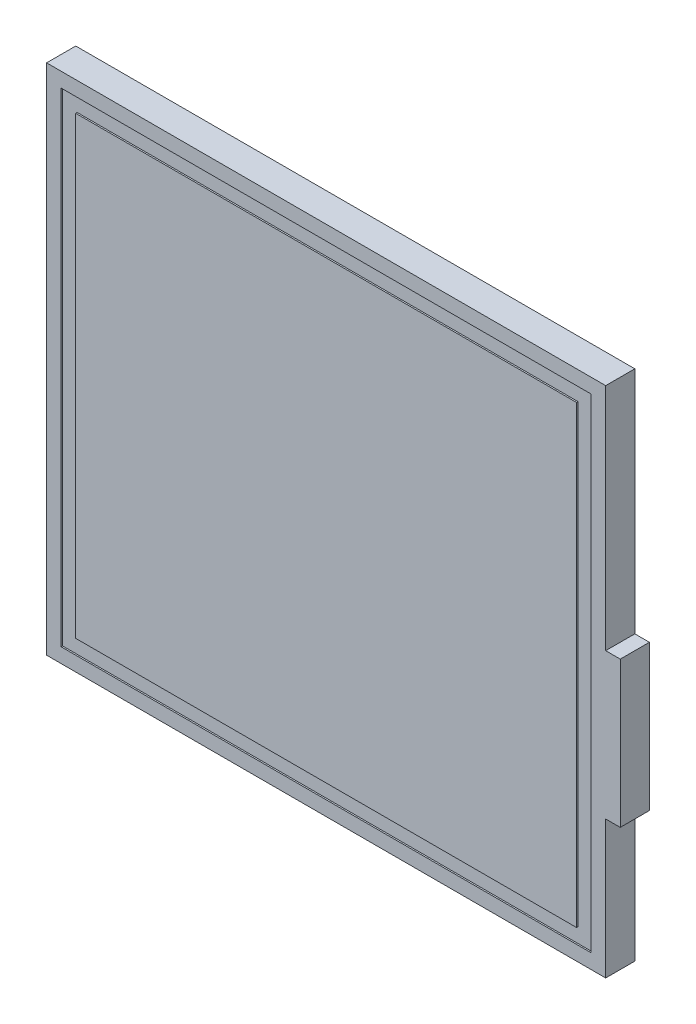
ISO-10303-21;
HEADER;
FILE_DESCRIPTION(('STEP AP214'),'2;1');
FILE_NAME('part.step','',(''),(''),'','','');
FILE_SCHEMA(('AUTOMOTIVE_DESIGN { 1 0 10303 214 1 1 1 1 }'));
ENDSEC;
DATA;
#1=APPLICATION_CONTEXT('core data for automotive mechanical design processes');
#2=APPLICATION_PROTOCOL_DEFINITION('international standard','automotive_design',2000,#1);
#3=PRODUCT_CONTEXT('',#1,'mechanical');
#4=PRODUCT('Part','Part','',(#3));
#5=PRODUCT_RELATED_PRODUCT_CATEGORY('part','',(#4));
#6=PRODUCT_DEFINITION_FORMATION('','',#4);
#7=PRODUCT_DEFINITION_CONTEXT('part definition',#1,'design');
#8=PRODUCT_DEFINITION('design','',#6,#7);
#9=PRODUCT_DEFINITION_SHAPE('','',#8);
#10=(LENGTH_UNIT() NAMED_UNIT(*) SI_UNIT(.MILLI.,.METRE.));
#11=(NAMED_UNIT(*) PLANE_ANGLE_UNIT() SI_UNIT($,.RADIAN.));
#12=(NAMED_UNIT(*) SI_UNIT($,.STERADIAN.) SOLID_ANGLE_UNIT());
#13=UNCERTAINTY_MEASURE_WITH_UNIT(LENGTH_MEASURE(1.E-05),#10,'distance_accuracy_value','');
#14=(GEOMETRIC_REPRESENTATION_CONTEXT(3) GLOBAL_UNCERTAINTY_ASSIGNED_CONTEXT((#13)) GLOBAL_UNIT_ASSIGNED_CONTEXT((#10,
#11,#12)) REPRESENTATION_CONTEXT('',''));
#15=CARTESIAN_POINT('',(0.,0.,0.));
#16=DIRECTION('',(0.,0.,1.));
#17=DIRECTION('',(1.,0.,0.));
#18=AXIS2_PLACEMENT_3D('',#15,#16,#17);
#19=CARTESIAN_POINT('',(19.18,-33.95,5.));
#20=DIRECTION('',(-1.,0.,0.));
#21=DIRECTION('',(0.,0.,1.));
#22=AXIS2_PLACEMENT_3D('',#19,#20,#21);
#23=PLANE('',#22);
#24=DIRECTION('',(0.,0.,-1.));
#25=VECTOR('',#24,1.);
#26=CARTESIAN_POINT('',(19.18,-33.95,5.));
#27=LINE('',#26,#25);
#28=CARTESIAN_POINT('',(19.18,-33.95,5.));
#29=VERTEX_POINT('',#28);
#30=CARTESIAN_POINT('',(19.18,-33.95,3.));
#31=VERTEX_POINT('',#30);
#32=EDGE_CURVE('E362',#29,#31,#27,.T.);
#33=ORIENTED_EDGE('',*,*,#32,.T.);
#34=DIRECTION('',(0.,-1.,0.));
#35=VECTOR('',#34,1.);
#36=CARTESIAN_POINT('',(19.18,-24.5,3.));
#37=LINE('',#36,#35);
#38=CARTESIAN_POINT('',(19.18,-24.5,3.));
#39=VERTEX_POINT('',#38);
#40=EDGE_CURVE('E331',#39,#31,#37,.T.);
#41=ORIENTED_EDGE('',*,*,#40,.F.);
#42=DIRECTION('',(0.,0.,-1.));
#43=VECTOR('',#42,1.);
#44=CARTESIAN_POINT('',(19.18,-24.5,5.));
#45=LINE('',#44,#43);
#46=CARTESIAN_POINT('',(19.18,-24.5,5.));
#47=VERTEX_POINT('',#46);
#48=EDGE_CURVE('E11',#47,#39,#45,.T.);
#49=ORIENTED_EDGE('',*,*,#48,.F.);
#50=DIRECTION('',(0.,1.,0.));
#51=VECTOR('',#50,1.);
#52=CARTESIAN_POINT('',(19.18,-33.95,5.));
#53=LINE('',#52,#51);
#54=EDGE_CURVE('E345',#29,#47,#53,.T.);
#55=ORIENTED_EDGE('',*,*,#54,.F.);
#56=EDGE_LOOP('',(#33,#41,#49,#55));
#57=FACE_BOUND('',#56,.T.);
#58=ADVANCED_FACE('F36',(#57),#23,.F.);
#59=CARTESIAN_POINT('',(19.18,-24.5,5.));
#60=DIRECTION('',(0.,1.,0.));
#61=DIRECTION('',(0.,0.,1.));
#62=AXIS2_PLACEMENT_3D('',#59,#60,#61);
#63=PLANE('',#62);
#64=ORIENTED_EDGE('',*,*,#48,.T.);
#65=DIRECTION('',(-1.,0.,0.));
#66=VECTOR('',#65,1.);
#67=CARTESIAN_POINT('',(20.18,-24.5,3.));
#68=LINE('',#67,#66);
#69=CARTESIAN_POINT('',(20.18,-24.5,3.));
#70=VERTEX_POINT('',#69);
#71=EDGE_CURVE('E315',#70,#39,#68,.T.);
#72=ORIENTED_EDGE('',*,*,#71,.F.);
#73=DIRECTION('',(0.,0.,-1.));
#74=VECTOR('',#73,1.);
#75=CARTESIAN_POINT('',(20.18,-24.5,5.));
#76=LINE('',#75,#74);
#77=CARTESIAN_POINT('',(20.18,-24.5,5.));
#78=VERTEX_POINT('',#77);
#79=EDGE_CURVE('E43',#78,#70,#76,.T.);
#80=ORIENTED_EDGE('',*,*,#79,.F.);
#81=DIRECTION('',(1.,0.,0.));
#82=VECTOR('',#81,1.);
#83=CARTESIAN_POINT('',(19.18,-24.5,5.));
#84=LINE('',#83,#82);
#85=EDGE_CURVE('E348',#47,#78,#84,.T.);
#86=ORIENTED_EDGE('',*,*,#85,.F.);
#87=EDGE_LOOP('',(#64,#72,#80,#86));
#88=FACE_BOUND('',#87,.T.);
#89=ADVANCED_FACE('F388',(#88),#63,.F.);
#90=CARTESIAN_POINT('',(20.18,-24.5,5.));
#91=DIRECTION('',(-1.,0.,0.));
#92=DIRECTION('',(0.,0.,1.));
#93=AXIS2_PLACEMENT_3D('',#90,#91,#92);
#94=PLANE('',#93);
#95=ORIENTED_EDGE('',*,*,#79,.T.);
#96=DIRECTION('',(0.,-1.,0.));
#97=VECTOR('',#96,1.);
#98=CARTESIAN_POINT('',(20.18,-14.5,3.));
#99=LINE('',#98,#97);
#100=CARTESIAN_POINT('',(20.18,-14.5,3.));
#101=VERTEX_POINT('',#100);
#102=EDGE_CURVE('E343',#101,#70,#99,.T.);
#103=ORIENTED_EDGE('',*,*,#102,.F.);
#104=DIRECTION('',(0.,0.,-1.));
#105=VECTOR('',#104,1.);
#106=CARTESIAN_POINT('',(20.18,-14.5,5.));
#107=LINE('',#106,#105);
#108=CARTESIAN_POINT('',(20.18,-14.5,5.));
#109=VERTEX_POINT('',#108);
#110=EDGE_CURVE('E377',#109,#101,#107,.T.);
#111=ORIENTED_EDGE('',*,*,#110,.F.);
#112=DIRECTION('',(0.,1.,0.));
#113=VECTOR('',#112,1.);
#114=CARTESIAN_POINT('',(20.18,-24.5,5.));
#115=LINE('',#114,#113);
#116=EDGE_CURVE('E350',#78,#109,#115,.T.);
#117=ORIENTED_EDGE('',*,*,#116,.F.);
#118=EDGE_LOOP('',(#95,#103,#111,#117));
#119=FACE_BOUND('',#118,.T.);
#120=ADVANCED_FACE('F384',(#119),#94,.F.);
#121=CARTESIAN_POINT('',(20.18,-14.5,5.));
#122=DIRECTION('',(0.,-1.,0.));
#123=DIRECTION('',(0.,0.,-1.));
#124=AXIS2_PLACEMENT_3D('',#121,#122,#123);
#125=PLANE('',#124);
#126=ORIENTED_EDGE('',*,*,#110,.T.);
#127=DIRECTION('',(1.,0.,0.));
#128=VECTOR('',#127,1.);
#129=CARTESIAN_POINT('',(19.18,-14.5,3.));
#130=LINE('',#129,#128);
#131=CARTESIAN_POINT('',(19.18,-14.5,3.));
#132=VERTEX_POINT('',#131);
#133=EDGE_CURVE('E341',#132,#101,#130,.T.);
#134=ORIENTED_EDGE('',*,*,#133,.F.);
#135=DIRECTION('',(0.,0.,-1.));
#136=VECTOR('',#135,1.);
#137=CARTESIAN_POINT('',(19.18,-14.5,5.));
#138=LINE('',#137,#136);
#139=CARTESIAN_POINT('',(19.18,-14.5,5.));
#140=VERTEX_POINT('',#139);
#141=EDGE_CURVE('E374',#140,#132,#138,.T.);
#142=ORIENTED_EDGE('',*,*,#141,.F.);
#143=DIRECTION('',(-1.,0.,0.));
#144=VECTOR('',#143,1.);
#145=CARTESIAN_POINT('',(20.18,-14.5,5.));
#146=LINE('',#145,#144);
#147=EDGE_CURVE('E352',#109,#140,#146,.T.);
#148=ORIENTED_EDGE('',*,*,#147,.F.);
#149=EDGE_LOOP('',(#126,#134,#142,#148));
#150=FACE_BOUND('',#149,.T.);
#151=ADVANCED_FACE('F419',(#150),#125,.F.);
#152=CARTESIAN_POINT('',(19.18,-14.5,5.));
#153=DIRECTION('',(-1.,0.,0.));
#154=DIRECTION('',(0.,0.,1.));
#155=AXIS2_PLACEMENT_3D('',#152,#153,#154);
#156=PLANE('',#155);
#157=ORIENTED_EDGE('',*,*,#141,.T.);
#158=DIRECTION('',(0.,-1.,0.));
#159=VECTOR('',#158,1.);
#160=CARTESIAN_POINT('',(19.18,1.25,3.));
#161=LINE('',#160,#159);
#162=CARTESIAN_POINT('',(19.18,1.25,3.));
#163=VERTEX_POINT('',#162);
#164=EDGE_CURVE('E339',#163,#132,#161,.T.);
#165=ORIENTED_EDGE('',*,*,#164,.F.);
#166=DIRECTION('',(0.,0.,-1.));
#167=VECTOR('',#166,1.);
#168=CARTESIAN_POINT('',(19.18,1.25,5.));
#169=LINE('',#168,#167);
#170=CARTESIAN_POINT('',(19.18,1.25,5.));
#171=VERTEX_POINT('',#170);
#172=EDGE_CURVE('E371',#171,#163,#169,.T.);
#173=ORIENTED_EDGE('',*,*,#172,.F.);
#174=DIRECTION('',(0.,1.,0.));
#175=VECTOR('',#174,1.);
#176=CARTESIAN_POINT('',(19.18,-14.5,5.));
#177=LINE('',#176,#175);
#178=EDGE_CURVE('E354',#140,#171,#177,.T.);
#179=ORIENTED_EDGE('',*,*,#178,.F.);
#180=EDGE_LOOP('',(#157,#165,#173,#179));
#181=FACE_BOUND('',#180,.T.);
#182=ADVANCED_FACE('F414',(#181),#156,.F.);
#183=CARTESIAN_POINT('',(19.18,1.25,5.));
#184=DIRECTION('',(0.,-1.,0.));
#185=DIRECTION('',(0.,0.,-1.));
#186=AXIS2_PLACEMENT_3D('',#183,#184,#185);
#187=PLANE('',#186);
#188=ORIENTED_EDGE('',*,*,#172,.T.);
#189=DIRECTION('',(1.,0.,0.));
#190=VECTOR('',#189,1.);
#191=CARTESIAN_POINT('',(-19.18,1.25,3.));
#192=LINE('',#191,#190);
#193=CARTESIAN_POINT('',(-19.18,1.25,3.));
#194=VERTEX_POINT('',#193);
#195=EDGE_CURVE('E337',#194,#163,#192,.T.);
#196=ORIENTED_EDGE('',*,*,#195,.F.);
#197=DIRECTION('',(0.,0.,-1.));
#198=VECTOR('',#197,1.);
#199=CARTESIAN_POINT('',(-19.18,1.25,5.));
#200=LINE('',#199,#198);
#201=CARTESIAN_POINT('',(-19.18,1.25,5.));
#202=VERTEX_POINT('',#201);
#203=EDGE_CURVE('E368',#202,#194,#200,.T.);
#204=ORIENTED_EDGE('',*,*,#203,.F.);
#205=DIRECTION('',(-1.,0.,0.));
#206=VECTOR('',#205,1.);
#207=CARTESIAN_POINT('',(19.18,1.25,5.));
#208=LINE('',#207,#206);
#209=EDGE_CURVE('E356',#171,#202,#208,.T.);
#210=ORIENTED_EDGE('',*,*,#209,.F.);
#211=EDGE_LOOP('',(#188,#196,#204,#210));
#212=FACE_BOUND('',#211,.T.);
#213=ADVANCED_FACE('F409',(#212),#187,.F.);
#214=CARTESIAN_POINT('',(-19.18,1.25,5.));
#215=DIRECTION('',(1.,0.,0.));
#216=DIRECTION('',(0.,0.,-1.));
#217=AXIS2_PLACEMENT_3D('',#214,#215,#216);
#218=PLANE('',#217);
#219=ORIENTED_EDGE('',*,*,#203,.T.);
#220=DIRECTION('',(0.,1.,0.));
#221=VECTOR('',#220,1.);
#222=CARTESIAN_POINT('',(-19.18,-33.95,3.));
#223=LINE('',#222,#221);
#224=CARTESIAN_POINT('',(-19.18,-33.95,3.));
#225=VERTEX_POINT('',#224);
#226=EDGE_CURVE('E335',#225,#194,#223,.T.);
#227=ORIENTED_EDGE('',*,*,#226,.F.);
#228=DIRECTION('',(0.,0.,-1.));
#229=VECTOR('',#228,1.);
#230=CARTESIAN_POINT('',(-19.18,-33.95,5.));
#231=LINE('',#230,#229);
#232=CARTESIAN_POINT('',(-19.18,-33.95,5.));
#233=VERTEX_POINT('',#232);
#234=EDGE_CURVE('E365',#233,#225,#231,.T.);
#235=ORIENTED_EDGE('',*,*,#234,.F.);
#236=DIRECTION('',(0.,-1.,0.));
#237=VECTOR('',#236,1.);
#238=CARTESIAN_POINT('',(-19.18,1.25,5.));
#239=LINE('',#238,#237);
#240=EDGE_CURVE('E358',#202,#233,#239,.T.);
#241=ORIENTED_EDGE('',*,*,#240,.F.);
#242=EDGE_LOOP('',(#219,#227,#235,#241));
#243=FACE_BOUND('',#242,.T.);
#244=ADVANCED_FACE('F404',(#243),#218,.F.);
#245=CARTESIAN_POINT('',(-19.18,-33.95,5.));
#246=DIRECTION('',(0.,1.,0.));
#247=DIRECTION('',(0.,0.,1.));
#248=AXIS2_PLACEMENT_3D('',#245,#246,#247);
#249=PLANE('',#248);
#250=ORIENTED_EDGE('',*,*,#234,.T.);
#251=DIRECTION('',(-1.,0.,0.));
#252=VECTOR('',#251,1.);
#253=CARTESIAN_POINT('',(19.18,-33.95,3.));
#254=LINE('',#253,#252);
#255=EDGE_CURVE('E333',#31,#225,#254,.T.);
#256=ORIENTED_EDGE('',*,*,#255,.F.);
#257=ORIENTED_EDGE('',*,*,#32,.F.);
#258=DIRECTION('',(1.,0.,0.));
#259=VECTOR('',#258,1.);
#260=CARTESIAN_POINT('',(-19.18,-33.95,5.));
#261=LINE('',#260,#259);
#262=EDGE_CURVE('E360',#233,#29,#261,.T.);
#263=ORIENTED_EDGE('',*,*,#262,.F.);
#264=EDGE_LOOP('',(#250,#256,#257,#263));
#265=FACE_BOUND('',#264,.T.);
#266=ADVANCED_FACE('F399',(#265),#249,.F.);
#267=CARTESIAN_POINT('',(19.18,-24.5,5.));
#268=DIRECTION('',(0.,0.,-1.));
#269=DIRECTION('',(-1.,0.,0.));
#270=AXIS2_PLACEMENT_3D('',#267,#268,#269);
#271=PLANE('',#270);
#272=DIRECTION('',(0.,1.,0.));
#273=VECTOR('',#272,1.);
#274=CARTESIAN_POINT('',(18.18,-32.95,5.));
#275=LINE('',#274,#273);
#276=CARTESIAN_POINT('',(18.18,-32.95,5.));
#277=VERTEX_POINT('',#276);
#278=CARTESIAN_POINT('',(18.18,0.25,5.));
#279=VERTEX_POINT('',#278);
#280=EDGE_CURVE('E235',#277,#279,#275,.T.);
#281=ORIENTED_EDGE('',*,*,#280,.F.);
#282=DIRECTION('',(1.,0.,0.));
#283=VECTOR('',#282,1.);
#284=CARTESIAN_POINT('',(-18.18,-32.95,5.));
#285=LINE('',#284,#283);
#286=CARTESIAN_POINT('',(-18.18,-32.95,5.));
#287=VERTEX_POINT('',#286);
#288=EDGE_CURVE('E50',#287,#277,#285,.T.);
#289=ORIENTED_EDGE('',*,*,#288,.F.);
#290=DIRECTION('',(0.,-1.,0.));
#291=VECTOR('',#290,1.);
#292=CARTESIAN_POINT('',(-18.18,0.25,5.));
#293=LINE('',#292,#291);
#294=CARTESIAN_POINT('',(-18.18,0.25,5.));
#295=VERTEX_POINT('',#294);
#296=EDGE_CURVE('E241',#295,#287,#293,.T.);
#297=ORIENTED_EDGE('',*,*,#296,.F.);
#298=DIRECTION('',(-1.,0.,0.));
#299=VECTOR('',#298,1.);
#300=CARTESIAN_POINT('',(18.18,0.25,5.));
#301=LINE('',#300,#299);
#302=EDGE_CURVE('E238',#279,#295,#301,.T.);
#303=ORIENTED_EDGE('',*,*,#302,.F.);
#304=EDGE_LOOP('',(#281,#289,#297,#303));
#305=FACE_BOUND('',#304,.T.);
#306=ORIENTED_EDGE('',*,*,#54,.T.);
#307=ORIENTED_EDGE('',*,*,#85,.T.);
#308=ORIENTED_EDGE('',*,*,#116,.T.);
#309=ORIENTED_EDGE('',*,*,#147,.T.);
#310=ORIENTED_EDGE('',*,*,#178,.T.);
#311=ORIENTED_EDGE('',*,*,#209,.T.);
#312=ORIENTED_EDGE('',*,*,#240,.T.);
#313=ORIENTED_EDGE('',*,*,#262,.T.);
#314=EDGE_LOOP('',(#306,#307,#308,#309,#310,#311,#312,#313));
#315=FACE_BOUND('',#314,.T.);
#316=ADVANCED_FACE('F421',(#305,#315),#271,.F.);
#317=CARTESIAN_POINT('',(19.18,-24.5,3.));
#318=DIRECTION('',(0.,0.,1.));
#319=DIRECTION('',(1.,0.,0.));
#320=AXIS2_PLACEMENT_3D('',#317,#318,#319);
#321=PLANE('',#320);
#322=DIRECTION('',(-1.,0.,0.));
#323=VECTOR('',#322,1.);
#324=CARTESIAN_POINT('',(17.18,-21.5,3.));
#325=LINE('',#324,#323);
#326=CARTESIAN_POINT('',(17.18,-21.5,3.));
#327=VERTEX_POINT('',#326);
#328=CARTESIAN_POINT('',(16.18,-21.5,3.));
#329=VERTEX_POINT('',#328);
#330=EDGE_CURVE('E288',#327,#329,#325,.T.);
#331=ORIENTED_EDGE('',*,*,#330,.F.);
#332=DIRECTION('',(0.,-1.,0.));
#333=VECTOR('',#332,1.);
#334=CARTESIAN_POINT('',(17.18,-17.5,3.));
#335=LINE('',#334,#333);
#336=CARTESIAN_POINT('',(17.18,-17.5,3.));
#337=VERTEX_POINT('',#336);
#338=EDGE_CURVE('E309',#337,#327,#335,.T.);
#339=ORIENTED_EDGE('',*,*,#338,.F.);
#340=DIRECTION('',(1.,0.,0.));
#341=VECTOR('',#340,1.);
#342=CARTESIAN_POINT('',(16.18,-17.5,3.));
#343=LINE('',#342,#341);
#344=CARTESIAN_POINT('',(16.18,-17.5,3.));
#345=VERTEX_POINT('',#344);
#346=EDGE_CURVE('E306',#345,#337,#343,.T.);
#347=ORIENTED_EDGE('',*,*,#346,.F.);
#348=DIRECTION('',(0.,-1.,0.));
#349=VECTOR('',#348,1.);
#350=CARTESIAN_POINT('',(16.18,-1.75,3.));
#351=LINE('',#350,#349);
#352=CARTESIAN_POINT('',(16.18,-1.75,3.));
#353=VERTEX_POINT('',#352);
#354=EDGE_CURVE('E303',#353,#345,#351,.T.);
#355=ORIENTED_EDGE('',*,*,#354,.F.);
#356=DIRECTION('',(1.,0.,0.));
#357=VECTOR('',#356,1.);
#358=CARTESIAN_POINT('',(-16.18,-1.75,3.));
#359=LINE('',#358,#357);
#360=CARTESIAN_POINT('',(-16.18,-1.75,3.));
#361=VERTEX_POINT('',#360);
#362=EDGE_CURVE('E300',#361,#353,#359,.T.);
#363=ORIENTED_EDGE('',*,*,#362,.F.);
#364=DIRECTION('',(0.,1.,0.));
#365=VECTOR('',#364,1.);
#366=CARTESIAN_POINT('',(-16.18,-30.95,3.));
#367=LINE('',#366,#365);
#368=CARTESIAN_POINT('',(-16.18,-30.95,3.));
#369=VERTEX_POINT('',#368);
#370=EDGE_CURVE('E297',#369,#361,#367,.T.);
#371=ORIENTED_EDGE('',*,*,#370,.F.);
#372=DIRECTION('',(-1.,0.,0.));
#373=VECTOR('',#372,1.);
#374=CARTESIAN_POINT('',(16.18,-30.95,3.));
#375=LINE('',#374,#373);
#376=CARTESIAN_POINT('',(16.18,-30.95,3.));
#377=VERTEX_POINT('',#376);
#378=EDGE_CURVE('E294',#377,#369,#375,.T.);
#379=ORIENTED_EDGE('',*,*,#378,.F.);
#380=DIRECTION('',(0.,-1.,0.));
#381=VECTOR('',#380,1.);
#382=CARTESIAN_POINT('',(16.18,-21.5,3.));
#383=LINE('',#382,#381);
#384=EDGE_CURVE('E291',#329,#377,#383,.T.);
#385=ORIENTED_EDGE('',*,*,#384,.F.);
#386=EDGE_LOOP('',(#331,#339,#347,#355,#363,#371,#379,#385));
#387=FACE_BOUND('',#386,.T.);
#388=ORIENTED_EDGE('',*,*,#71,.T.);
#389=ORIENTED_EDGE('',*,*,#40,.T.);
#390=ORIENTED_EDGE('',*,*,#255,.T.);
#391=ORIENTED_EDGE('',*,*,#226,.T.);
#392=ORIENTED_EDGE('',*,*,#195,.T.);
#393=ORIENTED_EDGE('',*,*,#164,.T.);
#394=ORIENTED_EDGE('',*,*,#133,.T.);
#395=ORIENTED_EDGE('',*,*,#102,.T.);
#396=EDGE_LOOP('',(#388,#389,#390,#391,#392,#393,#394,#395));
#397=FACE_BOUND('',#396,.T.);
#398=ADVANCED_FACE('F392',(#387,#397),#321,.F.);
#399=CARTESIAN_POINT('',(17.18,-21.5,3.));
#400=DIRECTION('',(0.,-1.,0.));
#401=DIRECTION('',(0.,0.,-1.));
#402=AXIS2_PLACEMENT_3D('',#399,#400,#401);
#403=PLANE('',#402);
#404=DIRECTION('',(-1.,0.,0.));
#405=VECTOR('',#404,1.);
#406=CARTESIAN_POINT('',(17.18,-21.5,0.));
#407=LINE('',#406,#405);
#408=CARTESIAN_POINT('',(17.18,-21.5,0.));
#409=VERTEX_POINT('',#408);
#410=CARTESIAN_POINT('',(16.18,-21.5,0.));
#411=VERTEX_POINT('',#410);
#412=EDGE_CURVE('E259',#409,#411,#407,.T.);
#413=ORIENTED_EDGE('',*,*,#412,.F.);
#414=DIRECTION('',(0.,0.,-1.));
#415=VECTOR('',#414,1.);
#416=CARTESIAN_POINT('',(17.18,-21.5,3.));
#417=LINE('',#416,#415);
#418=EDGE_CURVE('E313',#327,#409,#417,.T.);
#419=ORIENTED_EDGE('',*,*,#418,.F.);
#420=ORIENTED_EDGE('',*,*,#330,.T.);
#421=DIRECTION('',(0.,0.,-1.));
#422=VECTOR('',#421,1.);
#423=CARTESIAN_POINT('',(16.18,-21.5,3.));
#424=LINE('',#423,#422);
#425=EDGE_CURVE('E312',#329,#411,#424,.T.);
#426=ORIENTED_EDGE('',*,*,#425,.T.);
#427=EDGE_LOOP('',(#413,#419,#420,#426));
#428=FACE_BOUND('',#427,.T.);
#429=ADVANCED_FACE('F429',(#428),#403,.T.);
#430=CARTESIAN_POINT('',(17.18,-17.5,3.));
#431=DIRECTION('',(1.,0.,0.));
#432=DIRECTION('',(0.,0.,-1.));
#433=AXIS2_PLACEMENT_3D('',#430,#431,#432);
#434=PLANE('',#433);
#435=DIRECTION('',(0.,-1.,0.));
#436=VECTOR('',#435,1.);
#437=CARTESIAN_POINT('',(17.18,-17.5,0.));
#438=LINE('',#437,#436);
#439=CARTESIAN_POINT('',(17.18,-17.5,0.));
#440=VERTEX_POINT('',#439);
#441=EDGE_CURVE('E285',#440,#409,#438,.T.);
#442=ORIENTED_EDGE('',*,*,#441,.F.);
#443=DIRECTION('',(0.,0.,-1.));
#444=VECTOR('',#443,1.);
#445=CARTESIAN_POINT('',(17.18,-17.5,3.));
#446=LINE('',#445,#444);
#447=EDGE_CURVE('E316',#337,#440,#446,.T.);
#448=ORIENTED_EDGE('',*,*,#447,.F.);
#449=ORIENTED_EDGE('',*,*,#338,.T.);
#450=ORIENTED_EDGE('',*,*,#418,.T.);
#451=EDGE_LOOP('',(#442,#448,#449,#450));
#452=FACE_BOUND('',#451,.T.);
#453=ADVANCED_FACE('F478',(#452),#434,.T.);
#454=CARTESIAN_POINT('',(16.18,-17.5,3.));
#455=DIRECTION('',(0.,1.,0.));
#456=DIRECTION('',(0.,0.,1.));
#457=AXIS2_PLACEMENT_3D('',#454,#455,#456);
#458=PLANE('',#457);
#459=DIRECTION('',(1.,0.,0.));
#460=VECTOR('',#459,1.);
#461=CARTESIAN_POINT('',(16.18,-17.5,0.));
#462=LINE('',#461,#460);
#463=CARTESIAN_POINT('',(16.18,-17.5,0.));
#464=VERTEX_POINT('',#463);
#465=EDGE_CURVE('E282',#464,#440,#462,.T.);
#466=ORIENTED_EDGE('',*,*,#465,.F.);
#467=DIRECTION('',(0.,0.,-1.));
#468=VECTOR('',#467,1.);
#469=CARTESIAN_POINT('',(16.18,-17.5,3.));
#470=LINE('',#469,#468);
#471=EDGE_CURVE('E318',#345,#464,#470,.T.);
#472=ORIENTED_EDGE('',*,*,#471,.F.);
#473=ORIENTED_EDGE('',*,*,#346,.T.);
#474=ORIENTED_EDGE('',*,*,#447,.T.);
#475=EDGE_LOOP('',(#466,#472,#473,#474));
#476=FACE_BOUND('',#475,.T.);
#477=ADVANCED_FACE('F488',(#476),#458,.T.);
#478=CARTESIAN_POINT('',(16.18,-1.75,3.));
#479=DIRECTION('',(1.,0.,0.));
#480=DIRECTION('',(0.,0.,-1.));
#481=AXIS2_PLACEMENT_3D('',#478,#479,#480);
#482=PLANE('',#481);
#483=DIRECTION('',(0.,-1.,0.));
#484=VECTOR('',#483,1.);
#485=CARTESIAN_POINT('',(16.18,-1.75,0.));
#486=LINE('',#485,#484);
#487=CARTESIAN_POINT('',(16.18,-1.75,0.));
#488=VERTEX_POINT('',#487);
#489=EDGE_CURVE('E279',#488,#464,#486,.T.);
#490=ORIENTED_EDGE('',*,*,#489,.F.);
#491=DIRECTION('',(0.,0.,-1.));
#492=VECTOR('',#491,1.);
#493=CARTESIAN_POINT('',(16.18,-1.75,3.));
#494=LINE('',#493,#492);
#495=EDGE_CURVE('E320',#353,#488,#494,.T.);
#496=ORIENTED_EDGE('',*,*,#495,.F.);
#497=ORIENTED_EDGE('',*,*,#354,.T.);
#498=ORIENTED_EDGE('',*,*,#471,.T.);
#499=EDGE_LOOP('',(#490,#496,#497,#498));
#500=FACE_BOUND('',#499,.T.);
#501=ADVANCED_FACE('F498',(#500),#482,.T.);
#502=CARTESIAN_POINT('',(-16.18,-1.75,3.));
#503=DIRECTION('',(0.,1.,0.));
#504=DIRECTION('',(0.,0.,1.));
#505=AXIS2_PLACEMENT_3D('',#502,#503,#504);
#506=PLANE('',#505);
#507=DIRECTION('',(1.,0.,0.));
#508=VECTOR('',#507,1.);
#509=CARTESIAN_POINT('',(-16.18,-1.75,0.));
#510=LINE('',#509,#508);
#511=CARTESIAN_POINT('',(-16.18,-1.75,0.));
#512=VERTEX_POINT('',#511);
#513=EDGE_CURVE('E276',#512,#488,#510,.T.);
#514=ORIENTED_EDGE('',*,*,#513,.F.);
#515=DIRECTION('',(0.,0.,-1.));
#516=VECTOR('',#515,1.);
#517=CARTESIAN_POINT('',(-16.18,-1.75,3.));
#518=LINE('',#517,#516);
#519=EDGE_CURVE('E322',#361,#512,#518,.T.);
#520=ORIENTED_EDGE('',*,*,#519,.F.);
#521=ORIENTED_EDGE('',*,*,#362,.T.);
#522=ORIENTED_EDGE('',*,*,#495,.T.);
#523=EDGE_LOOP('',(#514,#520,#521,#522));
#524=FACE_BOUND('',#523,.T.);
#525=ADVANCED_FACE('F508',(#524),#506,.T.);
#526=CARTESIAN_POINT('',(-16.18,-30.95,3.));
#527=DIRECTION('',(-1.,0.,0.));
#528=DIRECTION('',(0.,0.,1.));
#529=AXIS2_PLACEMENT_3D('',#526,#527,#528);
#530=PLANE('',#529);
#531=DIRECTION('',(0.,1.,0.));
#532=VECTOR('',#531,1.);
#533=CARTESIAN_POINT('',(-16.18,-30.95,0.));
#534=LINE('',#533,#532);
#535=CARTESIAN_POINT('',(-16.18,-30.95,0.));
#536=VERTEX_POINT('',#535);
#537=EDGE_CURVE('E273',#536,#512,#534,.T.);
#538=ORIENTED_EDGE('',*,*,#537,.F.);
#539=DIRECTION('',(0.,0.,-1.));
#540=VECTOR('',#539,1.);
#541=CARTESIAN_POINT('',(-16.18,-30.95,3.));
#542=LINE('',#541,#540);
#543=EDGE_CURVE('E324',#369,#536,#542,.T.);
#544=ORIENTED_EDGE('',*,*,#543,.F.);
#545=ORIENTED_EDGE('',*,*,#370,.T.);
#546=ORIENTED_EDGE('',*,*,#519,.T.);
#547=EDGE_LOOP('',(#538,#544,#545,#546));
#548=FACE_BOUND('',#547,.T.);
#549=ADVANCED_FACE('F518',(#548),#530,.T.);
#550=CARTESIAN_POINT('',(16.18,-30.95,3.));
#551=DIRECTION('',(0.,-1.,0.));
#552=DIRECTION('',(0.,0.,-1.));
#553=AXIS2_PLACEMENT_3D('',#550,#551,#552);
#554=PLANE('',#553);
#555=DIRECTION('',(-1.,0.,0.));
#556=VECTOR('',#555,1.);
#557=CARTESIAN_POINT('',(16.18,-30.95,0.));
#558=LINE('',#557,#556);
#559=CARTESIAN_POINT('',(16.18,-30.95,0.));
#560=VERTEX_POINT('',#559);
#561=EDGE_CURVE('E270',#560,#536,#558,.T.);
#562=ORIENTED_EDGE('',*,*,#561,.F.);
#563=DIRECTION('',(0.,0.,-1.));
#564=VECTOR('',#563,1.);
#565=CARTESIAN_POINT('',(16.18,-30.95,3.));
#566=LINE('',#565,#564);
#567=EDGE_CURVE('E326',#377,#560,#566,.T.);
#568=ORIENTED_EDGE('',*,*,#567,.F.);
#569=ORIENTED_EDGE('',*,*,#378,.T.);
#570=ORIENTED_EDGE('',*,*,#543,.T.);
#571=EDGE_LOOP('',(#562,#568,#569,#570));
#572=FACE_BOUND('',#571,.T.);
#573=ADVANCED_FACE('F528',(#572),#554,.T.);
#574=CARTESIAN_POINT('',(16.18,-21.5,3.));
#575=DIRECTION('',(1.,0.,0.));
#576=DIRECTION('',(0.,0.,-1.));
#577=AXIS2_PLACEMENT_3D('',#574,#575,#576);
#578=PLANE('',#577);
#579=DIRECTION('',(0.,-1.,0.));
#580=VECTOR('',#579,1.);
#581=CARTESIAN_POINT('',(16.18,-21.5,0.));
#582=LINE('',#581,#580);
#583=EDGE_CURVE('E267',#411,#560,#582,.T.);
#584=ORIENTED_EDGE('',*,*,#583,.F.);
#585=ORIENTED_EDGE('',*,*,#425,.F.);
#586=ORIENTED_EDGE('',*,*,#384,.T.);
#587=ORIENTED_EDGE('',*,*,#567,.T.);
#588=EDGE_LOOP('',(#584,#585,#586,#587));
#589=FACE_BOUND('',#588,.T.);
#590=ADVANCED_FACE('F538',(#589),#578,.T.);
#591=CARTESIAN_POINT('',(19.18,-24.5,0.));
#592=DIRECTION('',(0.,0.,-1.));
#593=DIRECTION('',(-1.,0.,0.));
#594=AXIS2_PLACEMENT_3D('',#591,#592,#593);
#595=PLANE('',#594);
#596=ORIENTED_EDGE('',*,*,#441,.T.);
#597=ORIENTED_EDGE('',*,*,#412,.T.);
#598=ORIENTED_EDGE('',*,*,#583,.T.);
#599=ORIENTED_EDGE('',*,*,#561,.T.);
#600=ORIENTED_EDGE('',*,*,#537,.T.);
#601=ORIENTED_EDGE('',*,*,#513,.T.);
#602=ORIENTED_EDGE('',*,*,#489,.T.);
#603=ORIENTED_EDGE('',*,*,#465,.T.);
#604=EDGE_LOOP('',(#596,#597,#598,#599,#600,#601,#602,#603));
#605=FACE_BOUND('',#604,.T.);
#606=ADVANCED_FACE('F548',(#605),#595,.T.);
#607=CARTESIAN_POINT('',(-18.18,-32.95,4.9));
#608=DIRECTION('',(0.,-1.,0.));
#609=DIRECTION('',(0.,0.,-1.));
#610=AXIS2_PLACEMENT_3D('',#607,#608,#609);
#611=PLANE('',#610);
#612=ORIENTED_EDGE('',*,*,#288,.T.);
#613=DIRECTION('',(0.,0.,1.));
#614=VECTOR('',#613,1.);
#615=CARTESIAN_POINT('',(18.18,-32.95,4.9));
#616=LINE('',#615,#614);
#617=CARTESIAN_POINT('',(18.18,-32.95,4.9));
#618=VERTEX_POINT('',#617);
#619=EDGE_CURVE('E256',#618,#277,#616,.T.);
#620=ORIENTED_EDGE('',*,*,#619,.F.);
#621=DIRECTION('',(1.,0.,0.));
#622=VECTOR('',#621,1.);
#623=CARTESIAN_POINT('',(-18.18,-32.95,4.9));
#624=LINE('',#623,#622);
#625=CARTESIAN_POINT('',(-18.18,-32.95,4.9));
#626=VERTEX_POINT('',#625);
#627=EDGE_CURVE('E244',#626,#618,#624,.T.);
#628=ORIENTED_EDGE('',*,*,#627,.F.);
#629=DIRECTION('',(0.,0.,1.));
#630=VECTOR('',#629,1.);
#631=CARTESIAN_POINT('',(-18.18,-32.95,4.9));
#632=LINE('',#631,#630);
#633=EDGE_CURVE('E257',#626,#287,#632,.T.);
#634=ORIENTED_EDGE('',*,*,#633,.T.);
#635=EDGE_LOOP('',(#612,#620,#628,#634));
#636=FACE_BOUND('',#635,.T.);
#637=ADVANCED_FACE('F557',(#636),#611,.F.);
#638=CARTESIAN_POINT('',(-18.18,0.25,4.9));
#639=DIRECTION('',(-1.,0.,0.));
#640=DIRECTION('',(0.,0.,1.));
#641=AXIS2_PLACEMENT_3D('',#638,#639,#640);
#642=PLANE('',#641);
#643=ORIENTED_EDGE('',*,*,#296,.T.);
#644=ORIENTED_EDGE('',*,*,#633,.F.);
#645=DIRECTION('',(0.,-1.,0.));
#646=VECTOR('',#645,1.);
#647=CARTESIAN_POINT('',(-18.18,0.25,4.9));
#648=LINE('',#647,#646);
#649=CARTESIAN_POINT('',(-18.18,0.25,4.9));
#650=VERTEX_POINT('',#649);
#651=EDGE_CURVE('E253',#650,#626,#648,.T.);
#652=ORIENTED_EDGE('',*,*,#651,.F.);
#653=DIRECTION('',(0.,0.,1.));
#654=VECTOR('',#653,1.);
#655=CARTESIAN_POINT('',(-18.18,0.25,4.9));
#656=LINE('',#655,#654);
#657=EDGE_CURVE('E260',#650,#295,#656,.T.);
#658=ORIENTED_EDGE('',*,*,#657,.T.);
#659=EDGE_LOOP('',(#643,#644,#652,#658));
#660=FACE_BOUND('',#659,.T.);
#661=ADVANCED_FACE('F570',(#660),#642,.F.);
#662=CARTESIAN_POINT('',(18.18,0.25,4.9));
#663=DIRECTION('',(0.,1.,0.));
#664=DIRECTION('',(0.,0.,1.));
#665=AXIS2_PLACEMENT_3D('',#662,#663,#664);
#666=PLANE('',#665);
#667=ORIENTED_EDGE('',*,*,#302,.T.);
#668=ORIENTED_EDGE('',*,*,#657,.F.);
#669=DIRECTION('',(-1.,0.,0.));
#670=VECTOR('',#669,1.);
#671=CARTESIAN_POINT('',(18.18,0.25,4.9));
#672=LINE('',#671,#670);
#673=CARTESIAN_POINT('',(18.18,0.25,4.9));
#674=VERTEX_POINT('',#673);
#675=EDGE_CURVE('E250',#674,#650,#672,.T.);
#676=ORIENTED_EDGE('',*,*,#675,.F.);
#677=DIRECTION('',(0.,0.,1.));
#678=VECTOR('',#677,1.);
#679=CARTESIAN_POINT('',(18.18,0.25,4.9));
#680=LINE('',#679,#678);
#681=EDGE_CURVE('E262',#674,#279,#680,.T.);
#682=ORIENTED_EDGE('',*,*,#681,.T.);
#683=EDGE_LOOP('',(#667,#668,#676,#682));
#684=FACE_BOUND('',#683,.T.);
#685=ADVANCED_FACE('F579',(#684),#666,.F.);
#686=CARTESIAN_POINT('',(18.18,-32.95,4.9));
#687=DIRECTION('',(1.,0.,0.));
#688=DIRECTION('',(0.,0.,-1.));
#689=AXIS2_PLACEMENT_3D('',#686,#687,#688);
#690=PLANE('',#689);
#691=ORIENTED_EDGE('',*,*,#280,.T.);
#692=ORIENTED_EDGE('',*,*,#681,.F.);
#693=DIRECTION('',(0.,1.,0.));
#694=VECTOR('',#693,1.);
#695=CARTESIAN_POINT('',(18.18,-32.95,4.9));
#696=LINE('',#695,#694);
#697=EDGE_CURVE('E247',#618,#674,#696,.T.);
#698=ORIENTED_EDGE('',*,*,#697,.F.);
#699=ORIENTED_EDGE('',*,*,#619,.T.);
#700=EDGE_LOOP('',(#691,#692,#698,#699));
#701=FACE_BOUND('',#700,.T.);
#702=ADVANCED_FACE('F589',(#701),#690,.F.);
#703=CARTESIAN_POINT('',(18.18,-32.95,4.9));
#704=DIRECTION('',(0.,0.,1.));
#705=DIRECTION('',(1.,0.,0.));
#706=AXIS2_PLACEMENT_3D('',#703,#704,#705);
#707=PLANE('',#706);
#708=DIRECTION('',(-1.,0.,0.));
#709=VECTOR('',#708,1.);
#710=CARTESIAN_POINT('',(17.18,-0.75,4.9));
#711=LINE('',#710,#709);
#712=CARTESIAN_POINT('',(17.18,-0.75,4.9));
#713=VERTEX_POINT('',#712);
#714=CARTESIAN_POINT('',(-17.18,-0.75,4.9));
#715=VERTEX_POINT('',#714);
#716=EDGE_CURVE('E228',#713,#715,#711,.T.);
#717=ORIENTED_EDGE('',*,*,#716,.F.);
#718=DIRECTION('',(0.,1.,0.));
#719=VECTOR('',#718,1.);
#720=CARTESIAN_POINT('',(17.18,-31.95,4.9));
#721=LINE('',#720,#719);
#722=CARTESIAN_POINT('',(17.18,-31.95,4.9));
#723=VERTEX_POINT('',#722);
#724=EDGE_CURVE('E198',#723,#713,#721,.T.);
#725=ORIENTED_EDGE('',*,*,#724,.F.);
#726=DIRECTION('',(1.,0.,0.));
#727=VECTOR('',#726,1.);
#728=CARTESIAN_POINT('',(-17.18,-31.95,4.9));
#729=LINE('',#728,#727);
#730=CARTESIAN_POINT('',(-17.18,-31.95,4.9));
#731=VERTEX_POINT('',#730);
#732=EDGE_CURVE('E224',#731,#723,#729,.T.);
#733=ORIENTED_EDGE('',*,*,#732,.F.);
#734=DIRECTION('',(0.,-1.,0.));
#735=VECTOR('',#734,1.);
#736=CARTESIAN_POINT('',(-17.18,-0.75,4.9));
#737=LINE('',#736,#735);
#738=EDGE_CURVE('E211',#715,#731,#737,.T.);
#739=ORIENTED_EDGE('',*,*,#738,.F.);
#740=EDGE_LOOP('',(#717,#725,#733,#739));
#741=FACE_BOUND('',#740,.T.);
#742=ORIENTED_EDGE('',*,*,#627,.T.);
#743=ORIENTED_EDGE('',*,*,#697,.T.);
#744=ORIENTED_EDGE('',*,*,#675,.T.);
#745=ORIENTED_EDGE('',*,*,#651,.T.);
#746=EDGE_LOOP('',(#742,#743,#744,#745));
#747=FACE_BOUND('',#746,.T.);
#748=ADVANCED_FACE('F599',(#741,#747),#707,.T.);
#749=CARTESIAN_POINT('',(-17.18,-0.75,4.9));
#750=DIRECTION('',(-1.,0.,0.));
#751=DIRECTION('',(0.,0.,1.));
#752=AXIS2_PLACEMENT_3D('',#749,#750,#751);
#753=PLANE('',#752);
#754=DIRECTION('',(0.,-1.,0.));
#755=VECTOR('',#754,1.);
#756=CARTESIAN_POINT('',(-17.18,-0.75,5.));
#757=LINE('',#756,#755);
#758=CARTESIAN_POINT('',(-17.18,-0.75,5.));
#759=VERTEX_POINT('',#758);
#760=CARTESIAN_POINT('',(-17.18,-31.95,5.));
#761=VERTEX_POINT('',#760);
#762=EDGE_CURVE('E218',#759,#761,#757,.T.);
#763=ORIENTED_EDGE('',*,*,#762,.F.);
#764=DIRECTION('',(0.,0.,1.));
#765=VECTOR('',#764,1.);
#766=CARTESIAN_POINT('',(-17.18,-0.75,4.9));
#767=LINE('',#766,#765);
#768=EDGE_CURVE('E202',#715,#759,#767,.T.);
#769=ORIENTED_EDGE('',*,*,#768,.F.);
#770=ORIENTED_EDGE('',*,*,#738,.T.);
#771=DIRECTION('',(0.,0.,1.));
#772=VECTOR('',#771,1.);
#773=CARTESIAN_POINT('',(-17.18,-31.95,4.9));
#774=LINE('',#773,#772);
#775=EDGE_CURVE('E230',#731,#761,#774,.T.);
#776=ORIENTED_EDGE('',*,*,#775,.T.);
#777=EDGE_LOOP('',(#763,#769,#770,#776));
#778=FACE_BOUND('',#777,.T.);
#779=ADVANCED_FACE('F609',(#778),#753,.T.);
#780=CARTESIAN_POINT('',(17.18,-0.75,4.9));
#781=DIRECTION('',(0.,1.,0.));
#782=DIRECTION('',(0.,0.,1.));
#783=AXIS2_PLACEMENT_3D('',#780,#781,#782);
#784=PLANE('',#783);
#785=DIRECTION('',(-1.,0.,0.));
#786=VECTOR('',#785,1.);
#787=CARTESIAN_POINT('',(17.18,-0.75,5.));
#788=LINE('',#787,#786);
#789=CARTESIAN_POINT('',(17.18,-0.75,5.));
#790=VERTEX_POINT('',#789);
#791=EDGE_CURVE('E206',#790,#759,#788,.T.);
#792=ORIENTED_EDGE('',*,*,#791,.F.);
#793=DIRECTION('',(0.,0.,1.));
#794=VECTOR('',#793,1.);
#795=CARTESIAN_POINT('',(17.18,-0.75,4.9));
#796=LINE('',#795,#794);
#797=EDGE_CURVE('E195',#713,#790,#796,.T.);
#798=ORIENTED_EDGE('',*,*,#797,.F.);
#799=ORIENTED_EDGE('',*,*,#716,.T.);
#800=ORIENTED_EDGE('',*,*,#768,.T.);
#801=EDGE_LOOP('',(#792,#798,#799,#800));
#802=FACE_BOUND('',#801,.T.);
#803=ADVANCED_FACE('F207',(#802),#784,.T.);
#804=CARTESIAN_POINT('',(17.18,-31.95,4.9));
#805=DIRECTION('',(1.,0.,0.));
#806=DIRECTION('',(0.,0.,-1.));
#807=AXIS2_PLACEMENT_3D('',#804,#805,#806);
#808=PLANE('',#807);
#809=DIRECTION('',(0.,1.,0.));
#810=VECTOR('',#809,1.);
#811=CARTESIAN_POINT('',(17.18,-31.95,5.));
#812=LINE('',#811,#810);
#813=CARTESIAN_POINT('',(17.18,-31.95,5.));
#814=VERTEX_POINT('',#813);
#815=EDGE_CURVE('E58',#814,#790,#812,.T.);
#816=ORIENTED_EDGE('',*,*,#815,.F.);
#817=DIRECTION('',(0.,0.,1.));
#818=VECTOR('',#817,1.);
#819=CARTESIAN_POINT('',(17.18,-31.95,4.9));
#820=LINE('',#819,#818);
#821=EDGE_CURVE('E203',#723,#814,#820,.T.);
#822=ORIENTED_EDGE('',*,*,#821,.F.);
#823=ORIENTED_EDGE('',*,*,#724,.T.);
#824=ORIENTED_EDGE('',*,*,#797,.T.);
#825=EDGE_LOOP('',(#816,#822,#823,#824));
#826=FACE_BOUND('',#825,.T.);
#827=ADVANCED_FACE('F197',(#826),#808,.T.);
#828=CARTESIAN_POINT('',(-17.18,-31.95,4.9));
#829=DIRECTION('',(0.,-1.,0.));
#830=DIRECTION('',(0.,0.,-1.));
#831=AXIS2_PLACEMENT_3D('',#828,#829,#830);
#832=PLANE('',#831);
#833=DIRECTION('',(1.,0.,0.));
#834=VECTOR('',#833,1.);
#835=CARTESIAN_POINT('',(-17.18,-31.95,5.));
#836=LINE('',#835,#834);
#837=EDGE_CURVE('E216',#761,#814,#836,.T.);
#838=ORIENTED_EDGE('',*,*,#837,.F.);
#839=ORIENTED_EDGE('',*,*,#775,.F.);
#840=ORIENTED_EDGE('',*,*,#732,.T.);
#841=ORIENTED_EDGE('',*,*,#821,.T.);
#842=EDGE_LOOP('',(#838,#839,#840,#841));
#843=FACE_BOUND('',#842,.T.);
#844=ADVANCED_FACE('F436',(#843),#832,.T.);
#845=ORIENTED_EDGE('',*,*,#762,.T.);
#846=ORIENTED_EDGE('',*,*,#837,.T.);
#847=ORIENTED_EDGE('',*,*,#815,.T.);
#848=ORIENTED_EDGE('',*,*,#791,.T.);
#849=EDGE_LOOP('',(#845,#846,#847,#848));
#850=FACE_BOUND('',#849,.T.);
#851=ADVANCED_FACE('F214',(#850),#271,.F.);
#852=CLOSED_SHELL('',(#58,#89,#120,#151,#182,#213,#244,#266,#316,#398,#429,#453,#477,#501,#525,
#549,#573,#590,#606,#637,#661,#685,#702,#748,#779,#803,#827,#844,#851));
#853=MANIFOLD_SOLID_BREP('B2',#852);
#854=ADVANCED_BREP_SHAPE_REPRESENTATION('',(#18,#853),#14);
#855=SHAPE_DEFINITION_REPRESENTATION(#9,#854);
ENDSEC;
END-ISO-10303-21;
